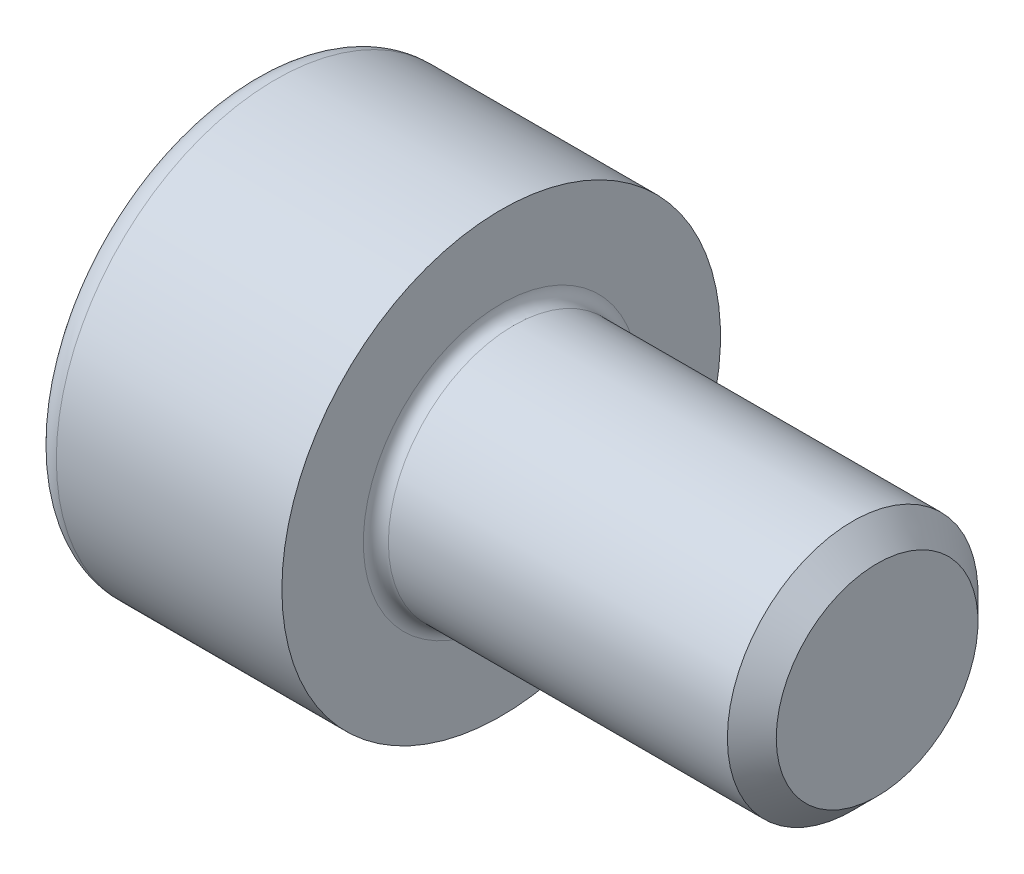
ISO-10303-21;
HEADER;
FILE_DESCRIPTION(('STEP AP214'),'2;1');
FILE_NAME('part.step','',(''),(''),'','','');
FILE_SCHEMA(('AUTOMOTIVE_DESIGN { 1 0 10303 214 1 1 1 1 }'));
ENDSEC;
DATA;
#1=APPLICATION_CONTEXT('core data for automotive mechanical design processes');
#2=APPLICATION_PROTOCOL_DEFINITION('international standard','automotive_design',2000,#1);
#3=PRODUCT_CONTEXT('',#1,'mechanical');
#4=PRODUCT('Part','Part','',(#3));
#5=PRODUCT_RELATED_PRODUCT_CATEGORY('part','',(#4));
#6=PRODUCT_DEFINITION_FORMATION('','',#4);
#7=PRODUCT_DEFINITION_CONTEXT('part definition',#1,'design');
#8=PRODUCT_DEFINITION('design','',#6,#7);
#9=PRODUCT_DEFINITION_SHAPE('','',#8);
#10=(LENGTH_UNIT() NAMED_UNIT(*) SI_UNIT(.MILLI.,.METRE.));
#11=(NAMED_UNIT(*) PLANE_ANGLE_UNIT() SI_UNIT($,.RADIAN.));
#12=(NAMED_UNIT(*) SI_UNIT($,.STERADIAN.) SOLID_ANGLE_UNIT());
#13=UNCERTAINTY_MEASURE_WITH_UNIT(LENGTH_MEASURE(1.E-05),#10,'distance_accuracy_value','');
#14=(GEOMETRIC_REPRESENTATION_CONTEXT(3) GLOBAL_UNCERTAINTY_ASSIGNED_CONTEXT((#13)) GLOBAL_UNIT_ASSIGNED_CONTEXT((#10,
#11,#12)) REPRESENTATION_CONTEXT('',''));
#15=CARTESIAN_POINT('',(0.,0.,0.));
#16=DIRECTION('',(0.,0.,1.));
#17=DIRECTION('',(1.,0.,0.));
#18=AXIS2_PLACEMENT_3D('',#15,#16,#17);
#19=CARTESIAN_POINT('',(0.,0.,0.));
#20=DIRECTION('',(-1.,0.,0.));
#21=DIRECTION('',(0.,0.,1.));
#22=AXIS2_PLACEMENT_3D('',#19,#20,#21);
#23=PLANE('',#22);
#24=DIRECTION('',(0.,-0.499999999999999,0.866025403784439));
#25=VECTOR('',#24,1.);
#26=CARTESIAN_POINT('',(0.,1.74359781295267,0.));
#27=LINE('',#26,#25);
#28=CARTESIAN_POINT('',(0.,1.74359781295267,0.));
#29=VERTEX_POINT('',#28);
#30=CARTESIAN_POINT('',(0.,0.871798906476332,1.51));
#31=VERTEX_POINT('',#30);
#32=EDGE_CURVE('E400',#29,#31,#27,.T.);
#33=ORIENTED_EDGE('',*,*,#32,.T.);
#34=DIRECTION('',(0.,1.,0.));
#35=VECTOR('',#34,1.);
#36=CARTESIAN_POINT('',(0.,-0.871798906476339,1.51));
#37=LINE('',#36,#35);
#38=CARTESIAN_POINT('',(0.,-0.871798906476339,1.51));
#39=VERTEX_POINT('',#38);
#40=EDGE_CURVE('E142',#39,#31,#37,.T.);
#41=ORIENTED_EDGE('',*,*,#40,.F.);
#42=DIRECTION('',(0.,-0.500000000000001,-0.866025403784438));
#43=VECTOR('',#42,1.);
#44=CARTESIAN_POINT('',(0.,-0.871798906476339,1.51));
#45=LINE('',#44,#43);
#46=CARTESIAN_POINT('',(0.,-1.74359781295268,0.));
#47=VERTEX_POINT('',#46);
#48=EDGE_CURVE('E405',#39,#47,#45,.T.);
#49=ORIENTED_EDGE('',*,*,#48,.T.);
#50=DIRECTION('',(0.,0.499999999999998,-0.86602540378444));
#51=VECTOR('',#50,1.);
#52=CARTESIAN_POINT('',(0.,-1.74359781295268,0.));
#53=LINE('',#52,#51);
#54=CARTESIAN_POINT('',(0.,-0.871798906476343,-1.51));
#55=VERTEX_POINT('',#54);
#56=EDGE_CURVE('E409',#47,#55,#53,.T.);
#57=ORIENTED_EDGE('',*,*,#56,.T.);
#58=DIRECTION('',(0.,-1.,0.));
#59=VECTOR('',#58,1.);
#60=CARTESIAN_POINT('',(0.,0.871798906476327,-1.51));
#61=LINE('',#60,#59);
#62=CARTESIAN_POINT('',(0.,0.871798906476327,-1.51));
#63=VERTEX_POINT('',#62);
#64=EDGE_CURVE('E413',#63,#55,#61,.T.);
#65=ORIENTED_EDGE('',*,*,#64,.F.);
#66=DIRECTION('',(0.,-0.500000000000001,-0.866025403784438));
#67=VECTOR('',#66,1.);
#68=CARTESIAN_POINT('',(0.,1.74359781295267,0.));
#69=LINE('',#68,#67);
#70=EDGE_CURVE('E137',#29,#63,#69,.T.);
#71=ORIENTED_EDGE('',*,*,#70,.F.);
#72=EDGE_LOOP('',(#33,#41,#49,#57,#65,#71));
#73=FACE_BOUND('',#72,.T.);
#74=CARTESIAN_POINT('',(0.,0.,0.));
#75=DIRECTION('',(-1.,0.,0.));
#76=DIRECTION('',(0.,0.,1.));
#77=AXIS2_PLACEMENT_3D('',#74,#75,#76);
#78=CIRCLE('',#77,3.1);
#79=CARTESIAN_POINT('',(0.,0.,3.1));
#80=VERTEX_POINT('',#79);
#81=EDGE_CURVE('E52',#80,#80,#78,.T.);
#82=ORIENTED_EDGE('',*,*,#81,.T.);
#83=EDGE_LOOP('',(#82));
#84=FACE_BOUND('',#83,.T.);
#85=ADVANCED_FACE('F43',(#73,#84),#23,.T.);
#86=CARTESIAN_POINT('',(10.,1.61,0.));
#87=DIRECTION('',(1.,0.,0.));
#88=DIRECTION('',(0.,0.,-1.));
#89=AXIS2_PLACEMENT_3D('',#86,#87,#88);
#90=PLANE('',#89);
#91=CARTESIAN_POINT('',(10.,0.,0.));
#92=DIRECTION('',(-1.,0.,0.));
#93=DIRECTION('',(0.,0.,1.));
#94=AXIS2_PLACEMENT_3D('',#91,#92,#93);
#95=CIRCLE('',#94,1.61);
#96=CARTESIAN_POINT('',(10.,0.,1.61));
#97=VERTEX_POINT('',#96);
#98=EDGE_CURVE('E166',#97,#97,#95,.T.);
#99=ORIENTED_EDGE('',*,*,#98,.F.);
#100=EDGE_LOOP('',(#99));
#101=FACE_BOUND('',#100,.T.);
#102=ADVANCED_FACE('F194',(#101),#90,.T.);
#103=CARTESIAN_POINT('',(10.,0.,0.));
#104=DIRECTION('',(-1.,0.,0.));
#105=DIRECTION('',(0.,0.,1.));
#106=AXIS2_PLACEMENT_3D('',#103,#104,#105);
#107=CONICAL_SURFACE('',#106,1.61,0.785398163397445);
#108=CARTESIAN_POINT('',(9.61,0.,0.));
#109=DIRECTION('',(-1.,0.,0.));
#110=DIRECTION('',(0.,0.,1.));
#111=AXIS2_PLACEMENT_3D('',#108,#109,#110);
#112=CIRCLE('',#111,2.);
#113=CARTESIAN_POINT('',(9.61,0.,2.));
#114=VERTEX_POINT('',#113);
#115=EDGE_CURVE('E162',#114,#114,#112,.T.);
#116=ORIENTED_EDGE('',*,*,#115,.F.);
#117=EDGE_LOOP('',(#116));
#118=FACE_BOUND('',#117,.T.);
#119=ORIENTED_EDGE('',*,*,#98,.T.);
#120=EDGE_LOOP('',(#119));
#121=FACE_BOUND('',#120,.T.);
#122=ADVANCED_FACE('F200',(#118,#121),#107,.T.);
#123=CARTESIAN_POINT('',(-31.75,0.,0.));
#124=DIRECTION('',(-1.,0.,0.));
#125=DIRECTION('',(0.,0.,1.));
#126=AXIS2_PLACEMENT_3D('',#123,#124,#125);
#127=CYLINDRICAL_SURFACE('',#126,2.);
#128=CARTESIAN_POINT('',(4.2,0.,0.));
#129=DIRECTION('',(1.,0.,0.));
#130=DIRECTION('',(0.,0.,-1.));
#131=AXIS2_PLACEMENT_3D('',#128,#129,#130);
#132=CIRCLE('',#131,2.);
#133=CARTESIAN_POINT('',(4.2,0.,-2.));
#134=VERTEX_POINT('',#133);
#135=EDGE_CURVE('E174',#134,#134,#132,.T.);
#136=ORIENTED_EDGE('',*,*,#135,.T.);
#137=EDGE_LOOP('',(#136));
#138=FACE_BOUND('',#137,.T.);
#139=ORIENTED_EDGE('',*,*,#115,.T.);
#140=EDGE_LOOP('',(#139));
#141=FACE_BOUND('',#140,.T.);
#142=ADVANCED_FACE('F212',(#138,#141),#127,.T.);
#143=CARTESIAN_POINT('',(4.,3.5,0.));
#144=DIRECTION('',(1.,0.,0.));
#145=DIRECTION('',(0.,0.,-1.));
#146=AXIS2_PLACEMENT_3D('',#143,#144,#145);
#147=PLANE('',#146);
#148=CARTESIAN_POINT('',(4.,0.,0.));
#149=DIRECTION('',(1.,0.,0.));
#150=DIRECTION('',(0.,0.,-1.));
#151=AXIS2_PLACEMENT_3D('',#148,#149,#150);
#152=CIRCLE('',#151,2.2);
#153=CARTESIAN_POINT('',(4.,0.,-2.2));
#154=VERTEX_POINT('',#153);
#155=EDGE_CURVE('E170',#154,#154,#152,.F.);
#156=ORIENTED_EDGE('',*,*,#155,.T.);
#157=EDGE_LOOP('',(#156));
#158=FACE_BOUND('',#157,.T.);
#159=CARTESIAN_POINT('',(4.,0.,0.));
#160=DIRECTION('',(-1.,0.,0.));
#161=DIRECTION('',(0.,0.,1.));
#162=AXIS2_PLACEMENT_3D('',#159,#160,#161);
#163=CIRCLE('',#162,3.5);
#164=CARTESIAN_POINT('',(4.,0.,3.5));
#165=VERTEX_POINT('',#164);
#166=EDGE_CURVE('E157',#165,#165,#163,.T.);
#167=ORIENTED_EDGE('',*,*,#166,.F.);
#168=EDGE_LOOP('',(#167));
#169=FACE_BOUND('',#168,.T.);
#170=ADVANCED_FACE('F208',(#158,#169),#147,.T.);
#171=CARTESIAN_POINT('',(-31.75,0.,0.));
#172=DIRECTION('',(-1.,0.,0.));
#173=DIRECTION('',(0.,0.,1.));
#174=AXIS2_PLACEMENT_3D('',#171,#172,#173);
#175=CYLINDRICAL_SURFACE('',#174,3.5);
#176=CARTESIAN_POINT('',(0.399999999999998,0.,0.));
#177=DIRECTION('',(-1.,0.,0.));
#178=DIRECTION('',(0.,0.,1.));
#179=AXIS2_PLACEMENT_3D('',#176,#177,#178);
#180=CIRCLE('',#179,3.5);
#181=CARTESIAN_POINT('',(0.399999999999998,0.,3.5));
#182=VERTEX_POINT('',#181);
#183=EDGE_CURVE('E11',#182,#182,#180,.F.);
#184=ORIENTED_EDGE('',*,*,#183,.T.);
#185=EDGE_LOOP('',(#184));
#186=FACE_BOUND('',#185,.T.);
#187=ORIENTED_EDGE('',*,*,#166,.T.);
#188=EDGE_LOOP('',(#187));
#189=FACE_BOUND('',#188,.T.);
#190=ADVANCED_FACE('F190',(#186,#189),#175,.T.);
#191=CARTESIAN_POINT('',(4.2,0.,0.));
#192=DIRECTION('',(1.,0.,0.));
#193=DIRECTION('',(0.,0.,-1.));
#194=AXIS2_PLACEMENT_3D('',#191,#192,#193);
#195=TOROIDAL_SURFACE('',#194,2.2,0.2);
#196=ORIENTED_EDGE('',*,*,#135,.F.);
#197=EDGE_LOOP('',(#196));
#198=FACE_BOUND('',#197,.T.);
#199=ORIENTED_EDGE('',*,*,#155,.F.);
#200=EDGE_LOOP('',(#199));
#201=FACE_BOUND('',#200,.T.);
#202=ADVANCED_FACE('F183',(#198,#201),#195,.F.);
#203=CARTESIAN_POINT('',(0.399999999999998,0.,0.));
#204=DIRECTION('',(-1.,0.,0.));
#205=DIRECTION('',(0.,0.,1.));
#206=AXIS2_PLACEMENT_3D('',#203,#204,#205);
#207=TOROIDAL_SURFACE('',#206,3.1,0.4);
#208=ORIENTED_EDGE('',*,*,#183,.F.);
#209=EDGE_LOOP('',(#208));
#210=FACE_BOUND('',#209,.T.);
#211=ORIENTED_EDGE('',*,*,#81,.F.);
#212=EDGE_LOOP('',(#211));
#213=FACE_BOUND('',#212,.T.);
#214=ADVANCED_FACE('F45',(#210,#213),#207,.T.);
#215=CARTESIAN_POINT('',(2.,1.74359781295267,0.));
#216=DIRECTION('',(0.,-0.866025403784439,-0.499999999999999));
#217=DIRECTION('',(0.,0.499999999999999,-0.866025403784439));
#218=AXIS2_PLACEMENT_3D('',#215,#216,#217);
#219=PLANE('',#218);
#220=ORIENTED_EDGE('',*,*,#32,.F.);
#221=DIRECTION('',(-1.,0.,0.));
#222=VECTOR('',#221,1.);
#223=CARTESIAN_POINT('',(2.,1.74359781295267,0.));
#224=LINE('',#223,#222);
#225=CARTESIAN_POINT('',(2.,1.74359781295267,0.));
#226=VERTEX_POINT('',#225);
#227=EDGE_CURVE('E387',#226,#29,#224,.T.);
#228=ORIENTED_EDGE('',*,*,#227,.F.);
#229=DIRECTION('',(0.,-0.499999999999999,0.866025403784439));
#230=VECTOR('',#229,1.);
#231=CARTESIAN_POINT('',(2.,1.74359781295267,0.));
#232=LINE('',#231,#230);
#233=CARTESIAN_POINT('',(2.,1.3076983597145,0.754999999999996));
#234=VERTEX_POINT('',#233);
#235=EDGE_CURVE('E128',#226,#234,#232,.T.);
#236=ORIENTED_EDGE('',*,*,#235,.T.);
#237=CARTESIAN_POINT('',(2.,0.871798906476332,1.51));
#238=VERTEX_POINT('',#237);
#239=EDGE_CURVE('E118',#234,#238,#232,.T.);
#240=ORIENTED_EDGE('',*,*,#239,.T.);
#241=DIRECTION('',(-1.,0.,0.));
#242=VECTOR('',#241,1.);
#243=CARTESIAN_POINT('',(2.,0.871798906476332,1.51));
#244=LINE('',#243,#242);
#245=EDGE_CURVE('E133',#238,#31,#244,.T.);
#246=ORIENTED_EDGE('',*,*,#245,.T.);
#247=EDGE_LOOP('',(#220,#228,#236,#240,#246));
#248=FACE_BOUND('',#247,.T.);
#249=ADVANCED_FACE('F132',(#248),#219,.T.);
#250=CARTESIAN_POINT('',(2.,-0.871798906476339,1.51));
#251=DIRECTION('',(0.,0.,1.));
#252=DIRECTION('',(0.,-1.,0.));
#253=AXIS2_PLACEMENT_3D('',#250,#251,#252);
#254=PLANE('',#253);
#255=ORIENTED_EDGE('',*,*,#40,.T.);
#256=ORIENTED_EDGE('',*,*,#245,.F.);
#257=DIRECTION('',(0.,1.,0.));
#258=VECTOR('',#257,1.);
#259=CARTESIAN_POINT('',(2.,-0.871798906476339,1.51));
#260=LINE('',#259,#258);
#261=CARTESIAN_POINT('',(2.,0.,1.51));
#262=VERTEX_POINT('',#261);
#263=EDGE_CURVE('E115',#262,#238,#260,.T.);
#264=ORIENTED_EDGE('',*,*,#263,.F.);
#265=CARTESIAN_POINT('',(2.,-0.871798906476339,1.51));
#266=VERTEX_POINT('',#265);
#267=EDGE_CURVE('E127',#266,#262,#260,.T.);
#268=ORIENTED_EDGE('',*,*,#267,.F.);
#269=DIRECTION('',(-1.,0.,0.));
#270=VECTOR('',#269,1.);
#271=CARTESIAN_POINT('',(2.,-0.871798906476339,1.51));
#272=LINE('',#271,#270);
#273=EDGE_CURVE('E145',#266,#39,#272,.T.);
#274=ORIENTED_EDGE('',*,*,#273,.T.);
#275=EDGE_LOOP('',(#255,#256,#264,#268,#274));
#276=FACE_BOUND('',#275,.T.);
#277=ADVANCED_FACE('F139',(#276),#254,.F.);
#278=CARTESIAN_POINT('',(2.,-0.871798906476339,1.51));
#279=DIRECTION('',(0.,0.866025403784438,-0.500000000000001));
#280=DIRECTION('',(0.,0.500000000000001,0.866025403784438));
#281=AXIS2_PLACEMENT_3D('',#278,#279,#280);
#282=PLANE('',#281);
#283=ORIENTED_EDGE('',*,*,#48,.F.);
#284=ORIENTED_EDGE('',*,*,#273,.F.);
#285=DIRECTION('',(0.,-0.500000000000001,-0.866025403784438));
#286=VECTOR('',#285,1.);
#287=CARTESIAN_POINT('',(2.,-0.871798906476339,1.51));
#288=LINE('',#287,#286);
#289=CARTESIAN_POINT('',(2.,-1.30769835971451,0.755000000000004));
#290=VERTEX_POINT('',#289);
#291=EDGE_CURVE('E443',#266,#290,#288,.T.);
#292=ORIENTED_EDGE('',*,*,#291,.T.);
#293=CARTESIAN_POINT('',(2.,-1.74359781295268,0.));
#294=VERTEX_POINT('',#293);
#295=EDGE_CURVE('E427',#290,#294,#288,.T.);
#296=ORIENTED_EDGE('',*,*,#295,.T.);
#297=DIRECTION('',(-1.,0.,0.));
#298=VECTOR('',#297,1.);
#299=CARTESIAN_POINT('',(2.,-1.74359781295268,0.));
#300=LINE('',#299,#298);
#301=EDGE_CURVE('E152',#294,#47,#300,.T.);
#302=ORIENTED_EDGE('',*,*,#301,.T.);
#303=EDGE_LOOP('',(#283,#284,#292,#296,#302));
#304=FACE_BOUND('',#303,.T.);
#305=ADVANCED_FACE('F276',(#304),#282,.T.);
#306=CARTESIAN_POINT('',(2.,-1.74359781295268,0.));
#307=DIRECTION('',(0.,0.86602540378444,0.499999999999998));
#308=DIRECTION('',(0.,-0.499999999999998,0.86602540378444));
#309=AXIS2_PLACEMENT_3D('',#306,#307,#308);
#310=PLANE('',#309);
#311=ORIENTED_EDGE('',*,*,#56,.F.);
#312=ORIENTED_EDGE('',*,*,#301,.F.);
#313=DIRECTION('',(0.,0.499999999999998,-0.86602540378444));
#314=VECTOR('',#313,1.);
#315=CARTESIAN_POINT('',(2.,-1.74359781295268,0.));
#316=LINE('',#315,#314);
#317=CARTESIAN_POINT('',(2.,-1.30769835971451,-0.755000000000001));
#318=VERTEX_POINT('',#317);
#319=EDGE_CURVE('E395',#294,#318,#316,.T.);
#320=ORIENTED_EDGE('',*,*,#319,.T.);
#321=CARTESIAN_POINT('',(2.,-0.871798906476343,-1.51));
#322=VERTEX_POINT('',#321);
#323=EDGE_CURVE('E441',#318,#322,#316,.T.);
#324=ORIENTED_EDGE('',*,*,#323,.T.);
#325=DIRECTION('',(-1.,0.,0.));
#326=VECTOR('',#325,1.);
#327=CARTESIAN_POINT('',(2.,-0.871798906476343,-1.51));
#328=LINE('',#327,#326);
#329=EDGE_CURVE('E386',#322,#55,#328,.T.);
#330=ORIENTED_EDGE('',*,*,#329,.T.);
#331=EDGE_LOOP('',(#311,#312,#320,#324,#330));
#332=FACE_BOUND('',#331,.T.);
#333=ADVANCED_FACE('F284',(#332),#310,.T.);
#334=CARTESIAN_POINT('',(2.,0.871798906476327,-1.51));
#335=DIRECTION('',(0.,0.,-1.));
#336=DIRECTION('',(0.,1.,0.));
#337=AXIS2_PLACEMENT_3D('',#334,#335,#336);
#338=PLANE('',#337);
#339=ORIENTED_EDGE('',*,*,#64,.T.);
#340=ORIENTED_EDGE('',*,*,#329,.F.);
#341=DIRECTION('',(0.,-1.,0.));
#342=VECTOR('',#341,1.);
#343=CARTESIAN_POINT('',(2.,0.871798906476327,-1.51));
#344=LINE('',#343,#342);
#345=CARTESIAN_POINT('',(2.,0.,-1.51));
#346=VERTEX_POINT('',#345);
#347=EDGE_CURVE('E390',#346,#322,#344,.T.);
#348=ORIENTED_EDGE('',*,*,#347,.F.);
#349=CARTESIAN_POINT('',(2.,0.871798906476327,-1.51));
#350=VERTEX_POINT('',#349);
#351=EDGE_CURVE('E59',#350,#346,#344,.T.);
#352=ORIENTED_EDGE('',*,*,#351,.F.);
#353=DIRECTION('',(-1.,0.,0.));
#354=VECTOR('',#353,1.);
#355=CARTESIAN_POINT('',(2.,0.871798906476327,-1.51));
#356=LINE('',#355,#354);
#357=EDGE_CURVE('E382',#350,#63,#356,.T.);
#358=ORIENTED_EDGE('',*,*,#357,.T.);
#359=EDGE_LOOP('',(#339,#340,#348,#352,#358));
#360=FACE_BOUND('',#359,.T.);
#361=ADVANCED_FACE('F293',(#360),#338,.F.);
#362=CARTESIAN_POINT('',(2.,1.74359781295267,0.));
#363=DIRECTION('',(0.,0.866025403784438,-0.500000000000001));
#364=DIRECTION('',(0.,0.500000000000001,0.866025403784438));
#365=AXIS2_PLACEMENT_3D('',#362,#363,#364);
#366=PLANE('',#365);
#367=ORIENTED_EDGE('',*,*,#70,.T.);
#368=ORIENTED_EDGE('',*,*,#357,.F.);
#369=DIRECTION('',(0.,-0.500000000000001,-0.866025403784438));
#370=VECTOR('',#369,1.);
#371=CARTESIAN_POINT('',(2.,1.74359781295267,0.));
#372=LINE('',#371,#370);
#373=CARTESIAN_POINT('',(2.,1.3076983597145,-0.755));
#374=VERTEX_POINT('',#373);
#375=EDGE_CURVE('E371',#374,#350,#372,.T.);
#376=ORIENTED_EDGE('',*,*,#375,.F.);
#377=EDGE_CURVE('E378',#226,#374,#372,.T.);
#378=ORIENTED_EDGE('',*,*,#377,.F.);
#379=ORIENTED_EDGE('',*,*,#227,.T.);
#380=EDGE_LOOP('',(#367,#368,#376,#378,#379));
#381=FACE_BOUND('',#380,.T.);
#382=ADVANCED_FACE('F302',(#381),#366,.F.);
#383=CARTESIAN_POINT('',(2.,2.615396719429,-1.51000000000001));
#384=DIRECTION('',(1.,0.,0.));
#385=DIRECTION('',(0.,0.,-1.));
#386=AXIS2_PLACEMENT_3D('',#383,#384,#385);
#387=PLANE('',#386);
#388=ORIENTED_EDGE('',*,*,#347,.T.);
#389=ORIENTED_EDGE('',*,*,#323,.F.);
#390=CARTESIAN_POINT('',(2.,0.,0.));
#391=DIRECTION('',(-1.,0.,0.));
#392=DIRECTION('',(0.,0.,1.));
#393=AXIS2_PLACEMENT_3D('',#390,#391,#392);
#394=CIRCLE('',#393,1.51);
#395=EDGE_CURVE('E435',#346,#318,#394,.T.);
#396=ORIENTED_EDGE('',*,*,#395,.F.);
#397=EDGE_LOOP('',(#388,#389,#396));
#398=FACE_BOUND('',#397,.T.);
#399=ADVANCED_FACE('F311',(#398),#387,.F.);
#400=ORIENTED_EDGE('',*,*,#319,.F.);
#401=ORIENTED_EDGE('',*,*,#295,.F.);
#402=EDGE_CURVE('E150',#318,#290,#394,.T.);
#403=ORIENTED_EDGE('',*,*,#402,.F.);
#404=EDGE_LOOP('',(#400,#401,#403));
#405=FACE_BOUND('',#404,.T.);
#406=ADVANCED_FACE('F320',(#405),#387,.F.);
#407=ORIENTED_EDGE('',*,*,#291,.F.);
#408=ORIENTED_EDGE('',*,*,#267,.T.);
#409=EDGE_CURVE('E144',#290,#262,#394,.T.);
#410=ORIENTED_EDGE('',*,*,#409,.F.);
#411=EDGE_LOOP('',(#407,#408,#410));
#412=FACE_BOUND('',#411,.T.);
#413=ADVANCED_FACE('F329',(#412),#387,.F.);
#414=ORIENTED_EDGE('',*,*,#263,.T.);
#415=ORIENTED_EDGE('',*,*,#239,.F.);
#416=EDGE_CURVE('E121',#262,#234,#394,.T.);
#417=ORIENTED_EDGE('',*,*,#416,.F.);
#418=EDGE_LOOP('',(#414,#415,#417));
#419=FACE_BOUND('',#418,.T.);
#420=ADVANCED_FACE('F117',(#419),#387,.F.);
#421=ORIENTED_EDGE('',*,*,#235,.F.);
#422=ORIENTED_EDGE('',*,*,#377,.T.);
#423=EDGE_CURVE('E158',#234,#374,#394,.T.);
#424=ORIENTED_EDGE('',*,*,#423,.F.);
#425=EDGE_LOOP('',(#421,#422,#424));
#426=FACE_BOUND('',#425,.T.);
#427=ADVANCED_FACE('F344',(#426),#387,.F.);
#428=ORIENTED_EDGE('',*,*,#375,.T.);
#429=ORIENTED_EDGE('',*,*,#351,.T.);
#430=EDGE_CURVE('E374',#374,#346,#394,.T.);
#431=ORIENTED_EDGE('',*,*,#430,.F.);
#432=EDGE_LOOP('',(#428,#429,#431));
#433=FACE_BOUND('',#432,.T.);
#434=ADVANCED_FACE('F259',(#433),#387,.F.);
#435=CARTESIAN_POINT('',(2.,0.,0.));
#436=DIRECTION('',(-1.,0.,0.));
#437=DIRECTION('',(0.,0.,1.));
#438=AXIS2_PLACEMENT_3D('',#435,#436,#437);
#439=CONICAL_SURFACE('',#438,1.51,1.04719755119659);
#440=CARTESIAN_POINT('',(2.87179890647635,0.,0.));
#441=VERTEX_POINT('',#440);
#442=VERTEX_LOOP('',#441);
#443=FACE_BOUND('',#442,.T.);
#444=ORIENTED_EDGE('',*,*,#416,.T.);
#445=ORIENTED_EDGE('',*,*,#423,.T.);
#446=ORIENTED_EDGE('',*,*,#430,.T.);
#447=ORIENTED_EDGE('',*,*,#395,.T.);
#448=ORIENTED_EDGE('',*,*,#402,.T.);
#449=ORIENTED_EDGE('',*,*,#409,.T.);
#450=EDGE_LOOP('',(#444,#445,#446,#447,#448,#449));
#451=FACE_BOUND('',#450,.T.);
#452=ADVANCED_FACE('F205',(#443,#451),#439,.F.);
#453=CLOSED_SHELL('',(#85,#102,#122,#142,#170,#190,#202,#214,#249,#277,#305,#333,#361,#382,#399,
#406,#413,#420,#427,#434,#452));
#454=MANIFOLD_SOLID_BREP('B2',#453);
#455=ADVANCED_BREP_SHAPE_REPRESENTATION('',(#18,#454),#14);
#456=SHAPE_DEFINITION_REPRESENTATION(#9,#455);
ENDSEC;
END-ISO-10303-21;
